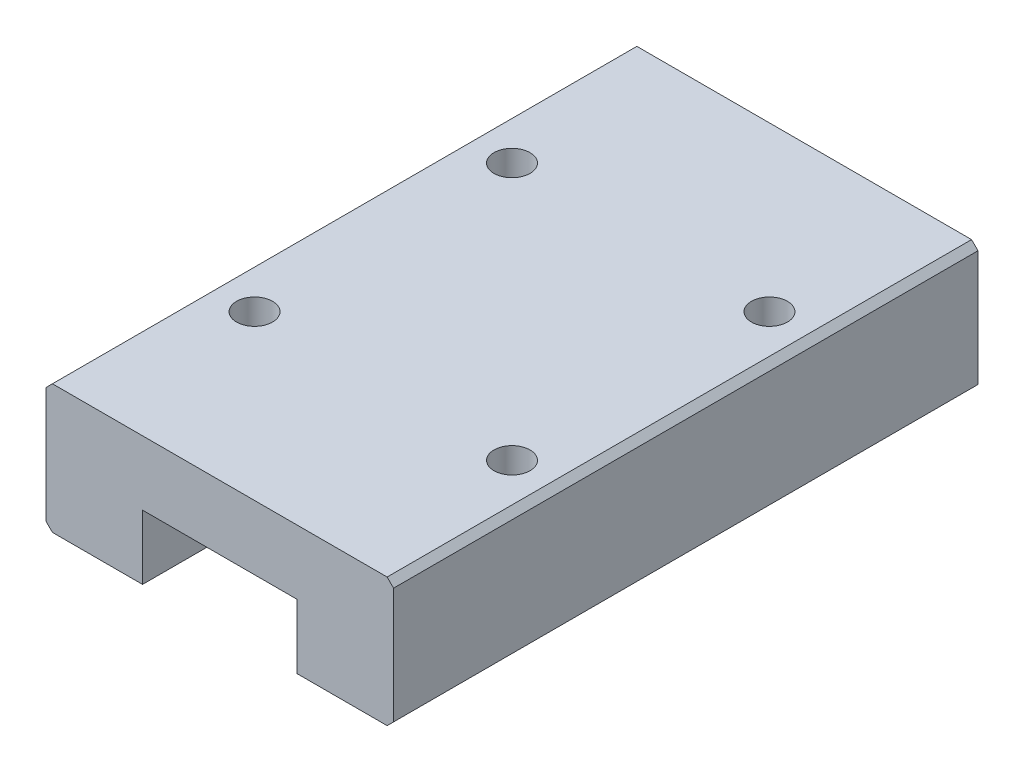
ISO-10303-21;
HEADER;
FILE_DESCRIPTION(('STEP AP214'),'2;1');
FILE_NAME('part.step','',(''),(''),'','','');
FILE_SCHEMA(('AUTOMOTIVE_DESIGN { 1 0 10303 214 1 1 1 1 }'));
ENDSEC;
DATA;
#1=APPLICATION_CONTEXT('core data for automotive mechanical design processes');
#2=APPLICATION_PROTOCOL_DEFINITION('international standard','automotive_design',2000,#1);
#3=PRODUCT_CONTEXT('',#1,'mechanical');
#4=PRODUCT('Part','Part','',(#3));
#5=PRODUCT_RELATED_PRODUCT_CATEGORY('part','',(#4));
#6=PRODUCT_DEFINITION_FORMATION('','',#4);
#7=PRODUCT_DEFINITION_CONTEXT('part definition',#1,'design');
#8=PRODUCT_DEFINITION('design','',#6,#7);
#9=PRODUCT_DEFINITION_SHAPE('','',#8);
#10=(LENGTH_UNIT() NAMED_UNIT(*) SI_UNIT(.MILLI.,.METRE.));
#11=(NAMED_UNIT(*) PLANE_ANGLE_UNIT() SI_UNIT($,.RADIAN.));
#12=(NAMED_UNIT(*) SI_UNIT($,.STERADIAN.) SOLID_ANGLE_UNIT());
#13=UNCERTAINTY_MEASURE_WITH_UNIT(LENGTH_MEASURE(1.E-05),#10,'distance_accuracy_value','');
#14=(GEOMETRIC_REPRESENTATION_CONTEXT(3) GLOBAL_UNCERTAINTY_ASSIGNED_CONTEXT((#13)) GLOBAL_UNIT_ASSIGNED_CONTEXT((#10,
#11,#12)) REPRESENTATION_CONTEXT('',''));
#15=CARTESIAN_POINT('',(0.,0.,0.));
#16=DIRECTION('',(0.,0.,1.));
#17=DIRECTION('',(1.,0.,0.));
#18=AXIS2_PLACEMENT_3D('',#15,#16,#17);
#19=CARTESIAN_POINT('',(-2.07692307692308,13.543956043956,45.4));
#20=DIRECTION('',(-0.707106781186548,0.707106781186547,0.));
#21=DIRECTION('',(-0.707106781186547,-0.707106781186548,0.));
#22=AXIS2_PLACEMENT_3D('',#19,#20,#21);
#23=PLANE('',#22);
#24=DIRECTION('',(0.707106781186547,0.707106781186548,0.));
#25=VECTOR('',#24,1.);
#26=CARTESIAN_POINT('',(-2.07692307692308,13.543956043956,0.));
#27=LINE('',#26,#25);
#28=CARTESIAN_POINT('',(-2.07692307692308,13.543956043956,0.));
#29=VERTEX_POINT('',#28);
#30=CARTESIAN_POINT('',(-1.57692307692308,14.043956043956,0.));
#31=VERTEX_POINT('',#30);
#32=EDGE_CURVE('E157',#29,#31,#27,.T.);
#33=ORIENTED_EDGE('',*,*,#32,.F.);
#34=DIRECTION('',(0.,0.,-1.));
#35=VECTOR('',#34,1.);
#36=CARTESIAN_POINT('',(-2.07692307692308,13.543956043956,45.4));
#37=LINE('',#36,#35);
#38=CARTESIAN_POINT('',(-2.07692307692308,13.543956043956,45.4));
#39=VERTEX_POINT('',#38);
#40=EDGE_CURVE('E11',#39,#29,#37,.T.);
#41=ORIENTED_EDGE('',*,*,#40,.F.);
#42=DIRECTION('',(0.707106781186547,0.707106781186548,0.));
#43=VECTOR('',#42,1.);
#44=CARTESIAN_POINT('',(-2.07692307692308,13.543956043956,45.4));
#45=LINE('',#44,#43);
#46=CARTESIAN_POINT('',(-1.57692307692308,14.043956043956,45.4));
#47=VERTEX_POINT('',#46);
#48=EDGE_CURVE('E187',#39,#47,#45,.T.);
#49=ORIENTED_EDGE('',*,*,#48,.T.);
#50=DIRECTION('',(0.,0.,-1.));
#51=VECTOR('',#50,1.);
#52=CARTESIAN_POINT('',(-1.57692307692308,14.043956043956,45.4));
#53=LINE('',#52,#51);
#54=EDGE_CURVE('E37',#47,#31,#53,.T.);
#55=ORIENTED_EDGE('',*,*,#54,.T.);
#56=EDGE_LOOP('',(#33,#41,#49,#55));
#57=FACE_BOUND('',#56,.T.);
#58=ADVANCED_FACE('F34',(#57),#23,.T.);
#59=CARTESIAN_POINT('',(-2.07692307692308,13.543956043956,45.4));
#60=DIRECTION('',(1.,0.,0.));
#61=DIRECTION('',(0.,1.,0.));
#62=AXIS2_PLACEMENT_3D('',#59,#60,#61);
#63=PLANE('',#62);
#64=DIRECTION('',(0.,-1.,0.));
#65=VECTOR('',#64,1.);
#66=CARTESIAN_POINT('',(-2.07692307692308,13.543956043956,0.));
#67=LINE('',#66,#65);
#68=CARTESIAN_POINT('',(-2.07692307692308,4.54395604395604,0.));
#69=VERTEX_POINT('',#68);
#70=EDGE_CURVE('E91',#29,#69,#67,.T.);
#71=ORIENTED_EDGE('',*,*,#70,.T.);
#72=DIRECTION('',(0.,0.,-1.));
#73=VECTOR('',#72,1.);
#74=CARTESIAN_POINT('',(-2.07692307692308,4.54395604395604,45.4));
#75=LINE('',#74,#73);
#76=CARTESIAN_POINT('',(-2.07692307692308,4.54395604395604,45.4));
#77=VERTEX_POINT('',#76);
#78=EDGE_CURVE('E43',#77,#69,#75,.T.);
#79=ORIENTED_EDGE('',*,*,#78,.F.);
#80=DIRECTION('',(0.,-1.,0.));
#81=VECTOR('',#80,1.);
#82=CARTESIAN_POINT('',(-2.07692307692308,13.543956043956,45.4));
#83=LINE('',#82,#81);
#84=EDGE_CURVE('E135',#39,#77,#83,.T.);
#85=ORIENTED_EDGE('',*,*,#84,.F.);
#86=ORIENTED_EDGE('',*,*,#40,.T.);
#87=EDGE_LOOP('',(#71,#79,#85,#86));
#88=FACE_BOUND('',#87,.T.);
#89=ADVANCED_FACE('F287',(#88),#63,.F.);
#90=CARTESIAN_POINT('',(-2.07692307692308,4.54395604395604,45.4));
#91=DIRECTION('',(0.707106781186548,0.707106781186547,0.));
#92=DIRECTION('',(-0.707106781186547,0.707106781186548,0.));
#93=AXIS2_PLACEMENT_3D('',#90,#91,#92);
#94=PLANE('',#93);
#95=DIRECTION('',(0.707106781186547,-0.707106781186548,0.));
#96=VECTOR('',#95,1.);
#97=CARTESIAN_POINT('',(-2.07692307692308,4.54395604395604,0.));
#98=LINE('',#97,#96);
#99=CARTESIAN_POINT('',(-1.57692307692308,4.04395604395604,0.));
#100=VERTEX_POINT('',#99);
#101=EDGE_CURVE('E142',#69,#100,#98,.T.);
#102=ORIENTED_EDGE('',*,*,#101,.T.);
#103=DIRECTION('',(0.,0.,-1.));
#104=VECTOR('',#103,1.);
#105=CARTESIAN_POINT('',(-1.57692307692308,4.04395604395604,45.4));
#106=LINE('',#105,#104);
#107=CARTESIAN_POINT('',(-1.57692307692308,4.04395604395604,45.4));
#108=VERTEX_POINT('',#107);
#109=EDGE_CURVE('E139',#108,#100,#106,.T.);
#110=ORIENTED_EDGE('',*,*,#109,.F.);
#111=DIRECTION('',(0.707106781186547,-0.707106781186548,0.));
#112=VECTOR('',#111,1.);
#113=CARTESIAN_POINT('',(-2.07692307692308,4.54395604395604,45.4));
#114=LINE('',#113,#112);
#115=EDGE_CURVE('E127',#77,#108,#114,.T.);
#116=ORIENTED_EDGE('',*,*,#115,.F.);
#117=ORIENTED_EDGE('',*,*,#78,.T.);
#118=EDGE_LOOP('',(#102,#110,#116,#117));
#119=FACE_BOUND('',#118,.T.);
#120=ADVANCED_FACE('F140',(#119),#94,.F.);
#121=CARTESIAN_POINT('',(-1.57692307692308,4.04395604395604,45.4));
#122=DIRECTION('',(0.,1.,0.));
#123=DIRECTION('',(0.,0.,1.));
#124=AXIS2_PLACEMENT_3D('',#121,#122,#123);
#125=PLANE('',#124);
#126=DIRECTION('',(1.,0.,0.));
#127=VECTOR('',#126,1.);
#128=CARTESIAN_POINT('',(-1.57692307692308,4.04395604395604,0.));
#129=LINE('',#128,#127);
#130=CARTESIAN_POINT('',(5.42307692307692,4.04395604395604,0.));
#131=VERTEX_POINT('',#130);
#132=EDGE_CURVE('E184',#100,#131,#129,.T.);
#133=ORIENTED_EDGE('',*,*,#132,.T.);
#134=DIRECTION('',(0.,0.,-1.));
#135=VECTOR('',#134,1.);
#136=CARTESIAN_POINT('',(5.42307692307692,4.04395604395604,45.4));
#137=LINE('',#136,#135);
#138=CARTESIAN_POINT('',(5.42307692307692,4.04395604395604,45.4));
#139=VERTEX_POINT('',#138);
#140=EDGE_CURVE('E146',#139,#131,#137,.T.);
#141=ORIENTED_EDGE('',*,*,#140,.F.);
#142=DIRECTION('',(1.,0.,0.));
#143=VECTOR('',#142,1.);
#144=CARTESIAN_POINT('',(-1.57692307692308,4.04395604395604,45.4));
#145=LINE('',#144,#143);
#146=EDGE_CURVE('E133',#108,#139,#145,.T.);
#147=ORIENTED_EDGE('',*,*,#146,.F.);
#148=ORIENTED_EDGE('',*,*,#109,.T.);
#149=EDGE_LOOP('',(#133,#141,#147,#148));
#150=FACE_BOUND('',#149,.T.);
#151=ADVANCED_FACE('F148',(#150),#125,.F.);
#152=CARTESIAN_POINT('',(5.42307692307692,9.04395604395604,45.4));
#153=DIRECTION('',(1.,0.,0.));
#154=DIRECTION('',(0.,1.,0.));
#155=AXIS2_PLACEMENT_3D('',#152,#153,#154);
#156=PLANE('',#155);
#157=DIRECTION('',(0.,-1.,0.));
#158=VECTOR('',#157,1.);
#159=CARTESIAN_POINT('',(5.42307692307692,9.04395604395604,0.));
#160=LINE('',#159,#158);
#161=CARTESIAN_POINT('',(5.42307692307692,9.04395604395604,0.));
#162=VERTEX_POINT('',#161);
#163=EDGE_CURVE('E181',#162,#131,#160,.T.);
#164=ORIENTED_EDGE('',*,*,#163,.F.);
#165=DIRECTION('',(0.,0.,-1.));
#166=VECTOR('',#165,1.);
#167=CARTESIAN_POINT('',(5.42307692307692,9.04395604395604,45.4));
#168=LINE('',#167,#166);
#169=CARTESIAN_POINT('',(5.42307692307692,9.04395604395604,45.4));
#170=VERTEX_POINT('',#169);
#171=EDGE_CURVE('E191',#170,#162,#168,.T.);
#172=ORIENTED_EDGE('',*,*,#171,.F.);
#173=DIRECTION('',(0.,-1.,0.));
#174=VECTOR('',#173,1.);
#175=CARTESIAN_POINT('',(5.42307692307692,9.04395604395604,45.4));
#176=LINE('',#175,#174);
#177=EDGE_CURVE('E150',#170,#139,#176,.T.);
#178=ORIENTED_EDGE('',*,*,#177,.T.);
#179=ORIENTED_EDGE('',*,*,#140,.T.);
#180=EDGE_LOOP('',(#164,#172,#178,#179));
#181=FACE_BOUND('',#180,.T.);
#182=ADVANCED_FACE('F212',(#181),#156,.T.);
#183=CARTESIAN_POINT('',(17.4230769230769,9.04395604395604,45.4));
#184=DIRECTION('',(0.,-1.,0.));
#185=DIRECTION('',(1.,0.,0.));
#186=AXIS2_PLACEMENT_3D('',#183,#184,#185);
#187=PLANE('',#186);
#188=DIRECTION('',(-1.,0.,0.));
#189=VECTOR('',#188,1.);
#190=CARTESIAN_POINT('',(17.4230769230769,9.04395604395604,0.));
#191=LINE('',#190,#189);
#192=CARTESIAN_POINT('',(17.4230769230769,9.04395604395604,0.));
#193=VERTEX_POINT('',#192);
#194=EDGE_CURVE('E178',#193,#162,#191,.T.);
#195=ORIENTED_EDGE('',*,*,#194,.F.);
#196=DIRECTION('',(0.,0.,-1.));
#197=VECTOR('',#196,1.);
#198=CARTESIAN_POINT('',(17.4230769230769,9.04395604395604,45.4));
#199=LINE('',#198,#197);
#200=CARTESIAN_POINT('',(17.4230769230769,9.04395604395604,45.4));
#201=VERTEX_POINT('',#200);
#202=EDGE_CURVE('E193',#201,#193,#199,.T.);
#203=ORIENTED_EDGE('',*,*,#202,.F.);
#204=DIRECTION('',(-1.,0.,0.));
#205=VECTOR('',#204,1.);
#206=CARTESIAN_POINT('',(17.4230769230769,9.04395604395604,45.4));
#207=LINE('',#206,#205);
#208=EDGE_CURVE('E152',#201,#170,#207,.T.);
#209=ORIENTED_EDGE('',*,*,#208,.T.);
#210=ORIENTED_EDGE('',*,*,#171,.T.);
#211=EDGE_LOOP('',(#195,#203,#209,#210));
#212=FACE_BOUND('',#211,.T.);
#213=ADVANCED_FACE('F216',(#212),#187,.T.);
#214=CARTESIAN_POINT('',(17.4230769230769,9.04395604395604,45.4));
#215=DIRECTION('',(1.,0.,0.));
#216=DIRECTION('',(0.,0.,-1.));
#217=AXIS2_PLACEMENT_3D('',#214,#215,#216);
#218=PLANE('',#217);
#219=DIRECTION('',(0.,-1.,0.));
#220=VECTOR('',#219,1.);
#221=CARTESIAN_POINT('',(17.4230769230769,9.04395604395604,0.));
#222=LINE('',#221,#220);
#223=CARTESIAN_POINT('',(17.4230769230769,4.04395604395604,0.));
#224=VERTEX_POINT('',#223);
#225=EDGE_CURVE('E176',#193,#224,#222,.T.);
#226=ORIENTED_EDGE('',*,*,#225,.T.);
#227=DIRECTION('',(0.,0.,-1.));
#228=VECTOR('',#227,1.);
#229=CARTESIAN_POINT('',(17.4230769230769,4.04395604395604,45.4));
#230=LINE('',#229,#228);
#231=CARTESIAN_POINT('',(17.4230769230769,4.04395604395604,45.4));
#232=VERTEX_POINT('',#231);
#233=EDGE_CURVE('E195',#232,#224,#230,.T.);
#234=ORIENTED_EDGE('',*,*,#233,.F.);
#235=DIRECTION('',(0.,-1.,0.));
#236=VECTOR('',#235,1.);
#237=CARTESIAN_POINT('',(17.4230769230769,9.04395604395604,45.4));
#238=LINE('',#237,#236);
#239=EDGE_CURVE('E218',#201,#232,#238,.T.);
#240=ORIENTED_EDGE('',*,*,#239,.F.);
#241=ORIENTED_EDGE('',*,*,#202,.T.);
#242=EDGE_LOOP('',(#226,#234,#240,#241));
#243=FACE_BOUND('',#242,.T.);
#244=ADVANCED_FACE('F305',(#243),#218,.F.);
#245=CARTESIAN_POINT('',(17.4230769230769,4.04395604395604,45.4));
#246=DIRECTION('',(0.,1.,0.));
#247=DIRECTION('',(0.,0.,1.));
#248=AXIS2_PLACEMENT_3D('',#245,#246,#247);
#249=PLANE('',#248);
#250=DIRECTION('',(1.,0.,0.));
#251=VECTOR('',#250,1.);
#252=CARTESIAN_POINT('',(17.4230769230769,4.04395604395604,0.));
#253=LINE('',#252,#251);
#254=CARTESIAN_POINT('',(24.4230769230769,4.04395604395604,0.));
#255=VERTEX_POINT('',#254);
#256=EDGE_CURVE('E173',#224,#255,#253,.T.);
#257=ORIENTED_EDGE('',*,*,#256,.T.);
#258=DIRECTION('',(0.,0.,-1.));
#259=VECTOR('',#258,1.);
#260=CARTESIAN_POINT('',(24.4230769230769,4.04395604395604,45.4));
#261=LINE('',#260,#259);
#262=CARTESIAN_POINT('',(24.4230769230769,4.04395604395604,45.4));
#263=VERTEX_POINT('',#262);
#264=EDGE_CURVE('E198',#263,#255,#261,.T.);
#265=ORIENTED_EDGE('',*,*,#264,.F.);
#266=DIRECTION('',(1.,0.,0.));
#267=VECTOR('',#266,1.);
#268=CARTESIAN_POINT('',(17.4230769230769,4.04395604395604,45.4));
#269=LINE('',#268,#267);
#270=EDGE_CURVE('E219',#232,#263,#269,.T.);
#271=ORIENTED_EDGE('',*,*,#270,.F.);
#272=ORIENTED_EDGE('',*,*,#233,.T.);
#273=EDGE_LOOP('',(#257,#265,#271,#272));
#274=FACE_BOUND('',#273,.T.);
#275=ADVANCED_FACE('F308',(#274),#249,.F.);
#276=CARTESIAN_POINT('',(24.9230769230769,4.54395604395604,45.4));
#277=DIRECTION('',(0.707106781186548,-0.707106781186548,0.));
#278=DIRECTION('',(0.707106781186548,0.707106781186548,0.));
#279=AXIS2_PLACEMENT_3D('',#276,#277,#278);
#280=PLANE('',#279);
#281=DIRECTION('',(-0.707106781186547,-0.707106781186547,0.));
#282=VECTOR('',#281,1.);
#283=CARTESIAN_POINT('',(24.9230769230769,4.54395604395604,0.));
#284=LINE('',#283,#282);
#285=CARTESIAN_POINT('',(24.9230769230769,4.54395604395604,0.));
#286=VERTEX_POINT('',#285);
#287=EDGE_CURVE('E170',#286,#255,#284,.T.);
#288=ORIENTED_EDGE('',*,*,#287,.F.);
#289=DIRECTION('',(0.,0.,-1.));
#290=VECTOR('',#289,1.);
#291=CARTESIAN_POINT('',(24.9230769230769,4.54395604395604,45.4));
#292=LINE('',#291,#290);
#293=CARTESIAN_POINT('',(24.9230769230769,4.54395604395604,45.4));
#294=VERTEX_POINT('',#293);
#295=EDGE_CURVE('E200',#294,#286,#292,.T.);
#296=ORIENTED_EDGE('',*,*,#295,.F.);
#297=DIRECTION('',(-0.707106781186547,-0.707106781186547,0.));
#298=VECTOR('',#297,1.);
#299=CARTESIAN_POINT('',(24.9230769230769,4.54395604395604,45.4));
#300=LINE('',#299,#298);
#301=EDGE_CURVE('E223',#294,#263,#300,.T.);
#302=ORIENTED_EDGE('',*,*,#301,.T.);
#303=ORIENTED_EDGE('',*,*,#264,.T.);
#304=EDGE_LOOP('',(#288,#296,#302,#303));
#305=FACE_BOUND('',#304,.T.);
#306=ADVANCED_FACE('F312',(#305),#280,.T.);
#307=CARTESIAN_POINT('',(24.9230769230769,13.543956043956,45.4));
#308=DIRECTION('',(1.,0.,0.));
#309=DIRECTION('',(0.,1.,0.));
#310=AXIS2_PLACEMENT_3D('',#307,#308,#309);
#311=PLANE('',#310);
#312=DIRECTION('',(0.,-1.,0.));
#313=VECTOR('',#312,1.);
#314=CARTESIAN_POINT('',(24.9230769230769,13.543956043956,0.));
#315=LINE('',#314,#313);
#316=CARTESIAN_POINT('',(24.9230769230769,13.543956043956,0.));
#317=VERTEX_POINT('',#316);
#318=EDGE_CURVE('E167',#317,#286,#315,.T.);
#319=ORIENTED_EDGE('',*,*,#318,.F.);
#320=DIRECTION('',(0.,0.,-1.));
#321=VECTOR('',#320,1.);
#322=CARTESIAN_POINT('',(24.9230769230769,13.543956043956,45.4));
#323=LINE('',#322,#321);
#324=CARTESIAN_POINT('',(24.9230769230769,13.543956043956,45.4));
#325=VERTEX_POINT('',#324);
#326=EDGE_CURVE('E202',#325,#317,#323,.T.);
#327=ORIENTED_EDGE('',*,*,#326,.F.);
#328=DIRECTION('',(0.,-1.,0.));
#329=VECTOR('',#328,1.);
#330=CARTESIAN_POINT('',(24.9230769230769,13.543956043956,45.4));
#331=LINE('',#330,#329);
#332=EDGE_CURVE('E226',#325,#294,#331,.T.);
#333=ORIENTED_EDGE('',*,*,#332,.T.);
#334=ORIENTED_EDGE('',*,*,#295,.T.);
#335=EDGE_LOOP('',(#319,#327,#333,#334));
#336=FACE_BOUND('',#335,.T.);
#337=ADVANCED_FACE('F316',(#336),#311,.T.);
#338=CARTESIAN_POINT('',(24.4230769230769,14.043956043956,45.4));
#339=DIRECTION('',(0.707106781186548,0.707106781186548,0.));
#340=DIRECTION('',(-0.707106781186548,0.707106781186548,0.));
#341=AXIS2_PLACEMENT_3D('',#338,#339,#340);
#342=PLANE('',#341);
#343=DIRECTION('',(0.707106781186547,-0.707106781186547,0.));
#344=VECTOR('',#343,1.);
#345=CARTESIAN_POINT('',(24.4230769230769,14.043956043956,0.));
#346=LINE('',#345,#344);
#347=CARTESIAN_POINT('',(24.4230769230769,14.043956043956,0.));
#348=VERTEX_POINT('',#347);
#349=EDGE_CURVE('E164',#348,#317,#346,.T.);
#350=ORIENTED_EDGE('',*,*,#349,.F.);
#351=DIRECTION('',(0.,0.,-1.));
#352=VECTOR('',#351,1.);
#353=CARTESIAN_POINT('',(24.4230769230769,14.043956043956,45.4));
#354=LINE('',#353,#352);
#355=CARTESIAN_POINT('',(24.4230769230769,14.043956043956,45.4));
#356=VERTEX_POINT('',#355);
#357=EDGE_CURVE('E203',#356,#348,#354,.T.);
#358=ORIENTED_EDGE('',*,*,#357,.F.);
#359=DIRECTION('',(0.707106781186547,-0.707106781186547,0.));
#360=VECTOR('',#359,1.);
#361=CARTESIAN_POINT('',(24.4230769230769,14.043956043956,45.4));
#362=LINE('',#361,#360);
#363=EDGE_CURVE('E229',#356,#325,#362,.T.);
#364=ORIENTED_EDGE('',*,*,#363,.T.);
#365=ORIENTED_EDGE('',*,*,#326,.T.);
#366=EDGE_LOOP('',(#350,#358,#364,#365));
#367=FACE_BOUND('',#366,.T.);
#368=ADVANCED_FACE('F263',(#367),#342,.T.);
#369=CARTESIAN_POINT('',(-1.57692307692308,14.043956043956,45.4));
#370=DIRECTION('',(0.,1.,0.));
#371=DIRECTION('',(0.,0.,1.));
#372=AXIS2_PLACEMENT_3D('',#369,#370,#371);
#373=PLANE('',#372);
#374=CARTESIAN_POINT('',(21.4230769230769,14.043956043956,32.7));
#375=DIRECTION('',(0.,1.,0.));
#376=DIRECTION('',(0.,0.,1.));
#377=AXIS2_PLACEMENT_3D('',#374,#375,#376);
#378=CIRCLE('',#377,1.40000000000001);
#379=CARTESIAN_POINT('',(21.4230769230769,14.043956043956,34.1));
#380=VERTEX_POINT('',#379);
#381=EDGE_CURVE('E255',#380,#380,#378,.T.);
#382=ORIENTED_EDGE('',*,*,#381,.F.);
#383=EDGE_LOOP('',(#382));
#384=FACE_BOUND('',#383,.T.);
#385=CARTESIAN_POINT('',(21.4230769230769,14.043956043956,12.7));
#386=DIRECTION('',(0.,1.,0.));
#387=DIRECTION('',(0.,0.,1.));
#388=AXIS2_PLACEMENT_3D('',#385,#386,#387);
#389=CIRCLE('',#388,1.40000000000001);
#390=CARTESIAN_POINT('',(21.4230769230769,14.043956043956,14.1));
#391=VERTEX_POINT('',#390);
#392=EDGE_CURVE('E249',#391,#391,#389,.T.);
#393=ORIENTED_EDGE('',*,*,#392,.F.);
#394=EDGE_LOOP('',(#393));
#395=FACE_BOUND('',#394,.T.);
#396=CARTESIAN_POINT('',(1.42307692307692,14.043956043956,12.7));
#397=DIRECTION('',(0.,1.,0.));
#398=DIRECTION('',(0.,0.,1.));
#399=AXIS2_PLACEMENT_3D('',#396,#397,#398);
#400=CIRCLE('',#399,1.40000000000001);
#401=CARTESIAN_POINT('',(1.42307692307692,14.043956043956,14.1));
#402=VERTEX_POINT('',#401);
#403=EDGE_CURVE('E243',#402,#402,#400,.T.);
#404=ORIENTED_EDGE('',*,*,#403,.F.);
#405=EDGE_LOOP('',(#404));
#406=FACE_BOUND('',#405,.T.);
#407=CARTESIAN_POINT('',(1.42307692307692,14.043956043956,32.7));
#408=DIRECTION('',(0.,1.,0.));
#409=DIRECTION('',(0.,0.,1.));
#410=AXIS2_PLACEMENT_3D('',#407,#408,#409);
#411=CIRCLE('',#410,1.40000000000001);
#412=CARTESIAN_POINT('',(1.42307692307692,14.043956043956,34.1));
#413=VERTEX_POINT('',#412);
#414=EDGE_CURVE('E237',#413,#413,#411,.T.);
#415=ORIENTED_EDGE('',*,*,#414,.F.);
#416=EDGE_LOOP('',(#415));
#417=FACE_BOUND('',#416,.T.);
#418=DIRECTION('',(1.,0.,0.));
#419=VECTOR('',#418,1.);
#420=CARTESIAN_POINT('',(-1.57692307692308,14.043956043956,0.));
#421=LINE('',#420,#419);
#422=EDGE_CURVE('E160',#31,#348,#421,.T.);
#423=ORIENTED_EDGE('',*,*,#422,.F.);
#424=ORIENTED_EDGE('',*,*,#54,.F.);
#425=DIRECTION('',(1.,0.,0.));
#426=VECTOR('',#425,1.);
#427=CARTESIAN_POINT('',(-1.57692307692308,14.043956043956,45.4));
#428=LINE('',#427,#426);
#429=EDGE_CURVE('E232',#47,#356,#428,.T.);
#430=ORIENTED_EDGE('',*,*,#429,.T.);
#431=ORIENTED_EDGE('',*,*,#357,.T.);
#432=EDGE_LOOP('',(#423,#424,#430,#431));
#433=FACE_BOUND('',#432,.T.);
#434=ADVANCED_FACE('F205',(#384,#395,#406,#417,#433),#373,.T.);
#435=CARTESIAN_POINT('',(0.,0.,45.4));
#436=DIRECTION('',(0.,0.,-1.));
#437=DIRECTION('',(-1.,0.,0.));
#438=AXIS2_PLACEMENT_3D('',#435,#436,#437);
#439=PLANE('',#438);
#440=ORIENTED_EDGE('',*,*,#48,.F.);
#441=ORIENTED_EDGE('',*,*,#84,.T.);
#442=ORIENTED_EDGE('',*,*,#115,.T.);
#443=ORIENTED_EDGE('',*,*,#146,.T.);
#444=ORIENTED_EDGE('',*,*,#177,.F.);
#445=ORIENTED_EDGE('',*,*,#208,.F.);
#446=ORIENTED_EDGE('',*,*,#239,.T.);
#447=ORIENTED_EDGE('',*,*,#270,.T.);
#448=ORIENTED_EDGE('',*,*,#301,.F.);
#449=ORIENTED_EDGE('',*,*,#332,.F.);
#450=ORIENTED_EDGE('',*,*,#363,.F.);
#451=ORIENTED_EDGE('',*,*,#429,.F.);
#452=EDGE_LOOP('',(#440,#441,#442,#443,#444,#445,#446,#447,#448,#449,#450,#451));
#453=FACE_BOUND('',#452,.T.);
#454=ADVANCED_FACE('F130',(#453),#439,.F.);
#455=CARTESIAN_POINT('',(0.,0.,0.));
#456=DIRECTION('',(0.,0.,-1.));
#457=DIRECTION('',(-1.,0.,0.));
#458=AXIS2_PLACEMENT_3D('',#455,#456,#457);
#459=PLANE('',#458);
#460=ORIENTED_EDGE('',*,*,#32,.T.);
#461=ORIENTED_EDGE('',*,*,#422,.T.);
#462=ORIENTED_EDGE('',*,*,#349,.T.);
#463=ORIENTED_EDGE('',*,*,#318,.T.);
#464=ORIENTED_EDGE('',*,*,#287,.T.);
#465=ORIENTED_EDGE('',*,*,#256,.F.);
#466=ORIENTED_EDGE('',*,*,#225,.F.);
#467=ORIENTED_EDGE('',*,*,#194,.T.);
#468=ORIENTED_EDGE('',*,*,#163,.T.);
#469=ORIENTED_EDGE('',*,*,#132,.F.);
#470=ORIENTED_EDGE('',*,*,#101,.F.);
#471=ORIENTED_EDGE('',*,*,#70,.F.);
#472=EDGE_LOOP('',(#460,#461,#462,#463,#464,#465,#466,#467,#468,#469,#470,#471));
#473=FACE_BOUND('',#472,.T.);
#474=ADVANCED_FACE('F207',(#473),#459,.T.);
#475=CARTESIAN_POINT('',(1.42307692307692,10.543956043956,32.7));
#476=DIRECTION('',(0.,-1.,0.));
#477=DIRECTION('',(0.,0.,-1.));
#478=AXIS2_PLACEMENT_3D('',#475,#476,#477);
#479=PLANE('',#478);
#480=CARTESIAN_POINT('',(1.42307692307692,10.543956043956,32.7));
#481=DIRECTION('',(0.,1.,0.));
#482=DIRECTION('',(0.,0.,1.));
#483=AXIS2_PLACEMENT_3D('',#480,#481,#482);
#484=CIRCLE('',#483,1.40000000000001);
#485=CARTESIAN_POINT('',(1.42307692307692,10.543956043956,34.1));
#486=VERTEX_POINT('',#485);
#487=EDGE_CURVE('E161',#486,#486,#484,.T.);
#488=ORIENTED_EDGE('',*,*,#487,.T.);
#489=EDGE_LOOP('',(#488));
#490=FACE_BOUND('',#489,.T.);
#491=ADVANCED_FACE('F273',(#490),#479,.F.);
#492=CARTESIAN_POINT('',(1.42307692307692,14.043956043956,32.7));
#493=DIRECTION('',(0.,1.,0.));
#494=DIRECTION('',(0.,0.,1.));
#495=AXIS2_PLACEMENT_3D('',#492,#493,#494);
#496=CYLINDRICAL_SURFACE('',#495,1.40000000000001);
#497=ORIENTED_EDGE('',*,*,#487,.F.);
#498=EDGE_LOOP('',(#497));
#499=FACE_BOUND('',#498,.T.);
#500=ORIENTED_EDGE('',*,*,#414,.T.);
#501=EDGE_LOOP('',(#500));
#502=FACE_BOUND('',#501,.T.);
#503=ADVANCED_FACE('F270',(#499,#502),#496,.F.);
#504=CARTESIAN_POINT('',(1.42307692307692,10.543956043956,12.7));
#505=DIRECTION('',(0.,-1.,0.));
#506=DIRECTION('',(0.,0.,-1.));
#507=AXIS2_PLACEMENT_3D('',#504,#505,#506);
#508=PLANE('',#507);
#509=CARTESIAN_POINT('',(1.42307692307692,10.543956043956,12.7));
#510=DIRECTION('',(0.,1.,0.));
#511=DIRECTION('',(0.,0.,1.));
#512=AXIS2_PLACEMENT_3D('',#509,#510,#511);
#513=CIRCLE('',#512,1.40000000000001);
#514=CARTESIAN_POINT('',(1.42307692307692,10.543956043956,14.1));
#515=VERTEX_POINT('',#514);
#516=EDGE_CURVE('E240',#515,#515,#513,.T.);
#517=ORIENTED_EDGE('',*,*,#516,.T.);
#518=EDGE_LOOP('',(#517));
#519=FACE_BOUND('',#518,.T.);
#520=ADVANCED_FACE('F272',(#519),#508,.F.);
#521=CARTESIAN_POINT('',(1.42307692307692,14.043956043956,12.7));
#522=DIRECTION('',(0.,1.,0.));
#523=DIRECTION('',(0.,0.,1.));
#524=AXIS2_PLACEMENT_3D('',#521,#522,#523);
#525=CYLINDRICAL_SURFACE('',#524,1.40000000000001);
#526=ORIENTED_EDGE('',*,*,#516,.F.);
#527=EDGE_LOOP('',(#526));
#528=FACE_BOUND('',#527,.T.);
#529=ORIENTED_EDGE('',*,*,#403,.T.);
#530=EDGE_LOOP('',(#529));
#531=FACE_BOUND('',#530,.T.);
#532=ADVANCED_FACE('F280',(#528,#531),#525,.F.);
#533=CARTESIAN_POINT('',(21.4230769230769,10.543956043956,12.7));
#534=DIRECTION('',(0.,-1.,0.));
#535=DIRECTION('',(0.,0.,-1.));
#536=AXIS2_PLACEMENT_3D('',#533,#534,#535);
#537=PLANE('',#536);
#538=CARTESIAN_POINT('',(21.4230769230769,10.543956043956,12.7));
#539=DIRECTION('',(0.,1.,0.));
#540=DIRECTION('',(0.,0.,1.));
#541=AXIS2_PLACEMENT_3D('',#538,#539,#540);
#542=CIRCLE('',#541,1.40000000000001);
#543=CARTESIAN_POINT('',(21.4230769230769,10.543956043956,14.1));
#544=VERTEX_POINT('',#543);
#545=EDGE_CURVE('E246',#544,#544,#542,.T.);
#546=ORIENTED_EDGE('',*,*,#545,.T.);
#547=EDGE_LOOP('',(#546));
#548=FACE_BOUND('',#547,.T.);
#549=ADVANCED_FACE('F373',(#548),#537,.F.);
#550=CARTESIAN_POINT('',(21.4230769230769,14.043956043956,12.7));
#551=DIRECTION('',(0.,1.,0.));
#552=DIRECTION('',(0.,0.,1.));
#553=AXIS2_PLACEMENT_3D('',#550,#551,#552);
#554=CYLINDRICAL_SURFACE('',#553,1.40000000000001);
#555=ORIENTED_EDGE('',*,*,#545,.F.);
#556=EDGE_LOOP('',(#555));
#557=FACE_BOUND('',#556,.T.);
#558=ORIENTED_EDGE('',*,*,#392,.T.);
#559=EDGE_LOOP('',(#558));
#560=FACE_BOUND('',#559,.T.);
#561=ADVANCED_FACE('F383',(#557,#560),#554,.F.);
#562=CARTESIAN_POINT('',(21.4230769230769,10.543956043956,32.7));
#563=DIRECTION('',(0.,-1.,0.));
#564=DIRECTION('',(0.,0.,-1.));
#565=AXIS2_PLACEMENT_3D('',#562,#563,#564);
#566=PLANE('',#565);
#567=CARTESIAN_POINT('',(21.4230769230769,10.543956043956,32.7));
#568=DIRECTION('',(0.,1.,0.));
#569=DIRECTION('',(0.,0.,1.));
#570=AXIS2_PLACEMENT_3D('',#567,#568,#569);
#571=CIRCLE('',#570,1.40000000000001);
#572=CARTESIAN_POINT('',(21.4230769230769,10.543956043956,34.1));
#573=VERTEX_POINT('',#572);
#574=EDGE_CURVE('E252',#573,#573,#571,.T.);
#575=ORIENTED_EDGE('',*,*,#574,.T.);
#576=EDGE_LOOP('',(#575));
#577=FACE_BOUND('',#576,.T.);
#578=ADVANCED_FACE('F393',(#577),#566,.F.);
#579=CARTESIAN_POINT('',(21.4230769230769,14.043956043956,32.7));
#580=DIRECTION('',(0.,1.,0.));
#581=DIRECTION('',(0.,0.,1.));
#582=AXIS2_PLACEMENT_3D('',#579,#580,#581);
#583=CYLINDRICAL_SURFACE('',#582,1.40000000000001);
#584=ORIENTED_EDGE('',*,*,#574,.F.);
#585=EDGE_LOOP('',(#584));
#586=FACE_BOUND('',#585,.T.);
#587=ORIENTED_EDGE('',*,*,#381,.T.);
#588=EDGE_LOOP('',(#587));
#589=FACE_BOUND('',#588,.T.);
#590=ADVANCED_FACE('F259',(#586,#589),#583,.F.);
#591=CLOSED_SHELL('',(#58,#89,#120,#151,#182,#213,#244,#275,#306,#337,#368,#434,#454,#474,#491,
#503,#520,#532,#549,#561,#578,#590));
#592=MANIFOLD_SOLID_BREP('B2',#591);
#593=ADVANCED_BREP_SHAPE_REPRESENTATION('',(#18,#592),#14);
#594=SHAPE_DEFINITION_REPRESENTATION(#9,#593);
ENDSEC;
END-ISO-10303-21;
